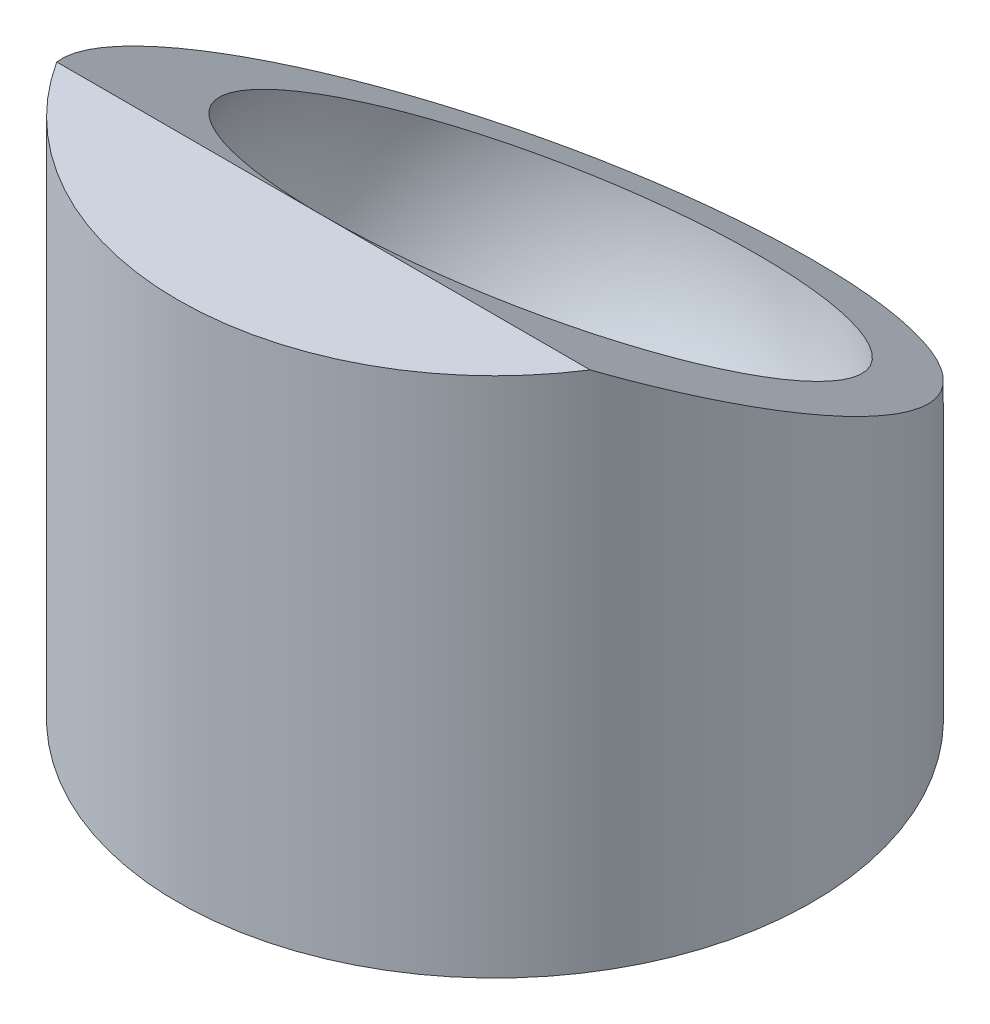
ISO-10303-21;
HEADER;
FILE_DESCRIPTION(('STEP AP214'),'2;1');
FILE_NAME('part.step','',(''),(''),'','','');
FILE_SCHEMA(('AUTOMOTIVE_DESIGN { 1 0 10303 214 1 1 1 1 }'));
ENDSEC;
DATA;
#1=APPLICATION_CONTEXT('core data for automotive mechanical design processes');
#2=APPLICATION_PROTOCOL_DEFINITION('international standard','automotive_design',2000,#1);
#3=PRODUCT_CONTEXT('',#1,'mechanical');
#4=PRODUCT('Part','Part','',(#3));
#5=PRODUCT_RELATED_PRODUCT_CATEGORY('part','',(#4));
#6=PRODUCT_DEFINITION_FORMATION('','',#4);
#7=PRODUCT_DEFINITION_CONTEXT('part definition',#1,'design');
#8=PRODUCT_DEFINITION('design','',#6,#7);
#9=PRODUCT_DEFINITION_SHAPE('','',#8);
#10=(LENGTH_UNIT() NAMED_UNIT(*) SI_UNIT(.MILLI.,.METRE.));
#11=(NAMED_UNIT(*) PLANE_ANGLE_UNIT() SI_UNIT($,.RADIAN.));
#12=(NAMED_UNIT(*) SI_UNIT($,.STERADIAN.) SOLID_ANGLE_UNIT());
#13=UNCERTAINTY_MEASURE_WITH_UNIT(LENGTH_MEASURE(1.E-05),#10,'distance_accuracy_value','');
#14=(GEOMETRIC_REPRESENTATION_CONTEXT(3) GLOBAL_UNCERTAINTY_ASSIGNED_CONTEXT((#13)) GLOBAL_UNIT_ASSIGNED_CONTEXT((#10,
#11,#12)) REPRESENTATION_CONTEXT('',''));
#15=CARTESIAN_POINT('',(0.,0.,0.));
#16=DIRECTION('',(0.,0.,1.));
#17=DIRECTION('',(1.,0.,0.));
#18=AXIS2_PLACEMENT_3D('',#15,#16,#17);
#19=CARTESIAN_POINT('',(0.,-12.,12.));
#20=DIRECTION('',(0.,1.,0.));
#21=DIRECTION('',(0.,0.,1.));
#22=AXIS2_PLACEMENT_3D('',#19,#20,#21);
#23=PLANE('',#22);
#24=CARTESIAN_POINT('',(0.,-12.,0.));
#25=DIRECTION('',(0.,-1.,0.));
#26=DIRECTION('',(0.,0.,-1.));
#27=AXIS2_PLACEMENT_3D('',#24,#25,#26);
#28=CIRCLE('',#27,12.);
#29=CARTESIAN_POINT('',(0.,-12.,-12.));
#30=VERTEX_POINT('',#29);
#31=EDGE_CURVE('E64',#30,#30,#28,.T.);
#32=ORIENTED_EDGE('',*,*,#31,.T.);
#33=EDGE_LOOP('',(#32));
#34=FACE_BOUND('',#33,.T.);
#35=ADVANCED_FACE('F33',(#34),#23,.F.);
#36=CARTESIAN_POINT('',(0.,-12.,0.));
#37=DIRECTION('',(0.,-1.,0.));
#38=DIRECTION('',(0.,0.,-1.));
#39=AXIS2_PLACEMENT_3D('',#36,#37,#38);
#40=CYLINDRICAL_SURFACE('',#39,12.);
#41=ORIENTED_EDGE('',*,*,#31,.F.);
#42=EDGE_LOOP('',(#41));
#43=FACE_BOUND('',#42,.T.);
#44=CARTESIAN_POINT('',(0.,7.73704887550172,0.));
#45=DIRECTION('',(0.,-1.,0.));
#46=DIRECTION('',(0.,0.,-1.));
#47=AXIS2_PLACEMENT_3D('',#44,#45,#46);
#48=CIRCLE('',#47,12.);
#49=CARTESIAN_POINT('',(10.092171485954,7.73704887550172,6.49215485783401));
#50=VERTEX_POINT('',#49);
#51=CARTESIAN_POINT('',(-10.092171485954,7.73704887550172,6.49215485783401));
#52=VERTEX_POINT('',#51);
#53=EDGE_CURVE('E11',#50,#52,#48,.T.);
#54=ORIENTED_EDGE('',*,*,#53,.T.);
#55=CARTESIAN_POINT('',(0.,3.98880152071047,0.));
#56=DIRECTION('',(0.,-0.866025403784439,0.499999999999999));
#57=DIRECTION('',(0.,-0.499999999999999,-0.866025403784439));
#58=AXIS2_PLACEMENT_3D('',#55,#56,#57);
#59=ELLIPSE('',#58,13.856406460551,12.);
#60=EDGE_CURVE('E41',#52,#50,#59,.T.);
#61=ORIENTED_EDGE('',*,*,#60,.T.);
#62=EDGE_LOOP('',(#54,#61));
#63=FACE_BOUND('',#62,.T.);
#64=ADVANCED_FACE('F63',(#43,#63),#40,.T.);
#65=CARTESIAN_POINT('',(-12.,-1.75384659443596,-9.94655830542331));
#66=DIRECTION('',(0.,-0.866025403784439,0.499999999999999));
#67=DIRECTION('',(0.,-0.499999999999999,-0.866025403784439));
#68=AXIS2_PLACEMENT_3D('',#65,#66,#67);
#69=PLANE('',#68);
#70=DIRECTION('',(1.,0.,0.));
#71=VECTOR('',#70,1.);
#72=CARTESIAN_POINT('',(-12.,7.73704887550172,6.49215485783401));
#73=LINE('',#72,#71);
#74=CARTESIAN_POINT('',(0.,7.73704887550172,6.492154857834));
#75=VERTEX_POINT('',#74);
#76=EDGE_CURVE('E57',#75,#50,#73,.T.);
#77=ORIENTED_EDGE('',*,*,#76,.T.);
#78=ORIENTED_EDGE('',*,*,#60,.F.);
#79=EDGE_CURVE('E48',#52,#75,#73,.T.);
#80=ORIENTED_EDGE('',*,*,#79,.T.);
#81=CARTESIAN_POINT('',(0.,2.99160114053286,-1.72720172379463));
#82=DIRECTION('',(0.,-0.866025403784439,0.499999999999999));
#83=DIRECTION('',(0.,-0.499999999999999,-0.866025403784439));
#84=AXIS2_PLACEMENT_3D('',#81,#82,#83);
#85=CIRCLE('',#84,9.49089546993767);
#86=EDGE_CURVE('E61',#75,#75,#85,.F.);
#87=ORIENTED_EDGE('',*,*,#86,.F.);
#88=EDGE_LOOP('',(#77,#78,#80,#87));
#89=FACE_BOUND('',#88,.T.);
#90=ADVANCED_FACE('F59',(#89),#69,.F.);
#91=CARTESIAN_POINT('',(-12.,7.73704887550172,6.49215485783401));
#92=DIRECTION('',(0.,-1.,0.));
#93=DIRECTION('',(0.,0.,-1.));
#94=AXIS2_PLACEMENT_3D('',#91,#92,#93);
#95=PLANE('',#94);
#96=ORIENTED_EDGE('',*,*,#76,.F.);
#97=ORIENTED_EDGE('',*,*,#79,.F.);
#98=ORIENTED_EDGE('',*,*,#53,.F.);
#99=EDGE_LOOP('',(#96,#97,#98));
#100=FACE_BOUND('',#99,.T.);
#101=ADVANCED_FACE('F56',(#100),#95,.F.);
#102=CARTESIAN_POINT('',(0.,0.,0.));
#103=DIRECTION('',(0.,-1.,0.));
#104=DIRECTION('',(0.,0.,-1.));
#105=AXIS2_PLACEMENT_3D('',#102,#103,#104);
#106=SPHERICAL_SURFACE('',#105,10.1);
#107=CARTESIAN_POINT('',(0.,0.,0.));
#108=DIRECTION('',(0.,-0.866025403784439,0.499999999999999));
#109=DIRECTION('',(0.,-0.499999999999999,-0.866025403784439));
#110=AXIS2_PLACEMENT_3D('',#107,#108,#109);
#111=SPHERICAL_SURFACE('',#110,10.1);
#112=ORIENTED_EDGE('',*,*,#86,.T.);
#113=EDGE_LOOP('',(#112));
#114=FACE_BOUND('',#113,.T.);
#115=ADVANCED_FACE('F35',(#114),#111,.F.);
#116=CLOSED_SHELL('',(#35,#64,#90,#101,#115));
#117=MANIFOLD_SOLID_BREP('B2',#116);
#118=ADVANCED_BREP_SHAPE_REPRESENTATION('',(#18,#117),#14);
#119=SHAPE_DEFINITION_REPRESENTATION(#9,#118);
ENDSEC;
END-ISO-10303-21;
